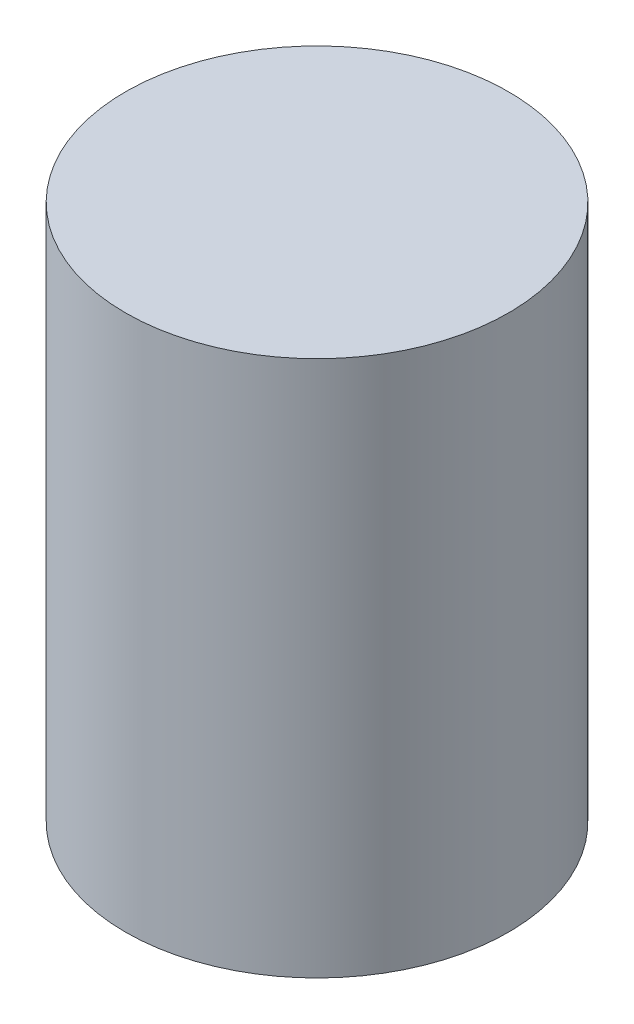
ISO-10303-21;
HEADER;
FILE_DESCRIPTION(('STEP AP214'),'2;1');
FILE_NAME('part.step','',(''),(''),'','','');
FILE_SCHEMA(('AUTOMOTIVE_DESIGN { 1 0 10303 214 1 1 1 1 }'));
ENDSEC;
DATA;
#1=APPLICATION_CONTEXT('core data for automotive mechanical design processes');
#2=APPLICATION_PROTOCOL_DEFINITION('international standard','automotive_design',2000,#1);
#3=PRODUCT_CONTEXT('',#1,'mechanical');
#4=PRODUCT('Part','Part','',(#3));
#5=PRODUCT_RELATED_PRODUCT_CATEGORY('part','',(#4));
#6=PRODUCT_DEFINITION_FORMATION('','',#4);
#7=PRODUCT_DEFINITION_CONTEXT('part definition',#1,'design');
#8=PRODUCT_DEFINITION('design','',#6,#7);
#9=PRODUCT_DEFINITION_SHAPE('','',#8);
#10=(LENGTH_UNIT() NAMED_UNIT(*) SI_UNIT(.MILLI.,.METRE.));
#11=(NAMED_UNIT(*) PLANE_ANGLE_UNIT() SI_UNIT($,.RADIAN.));
#12=(NAMED_UNIT(*) SI_UNIT($,.STERADIAN.) SOLID_ANGLE_UNIT());
#13=UNCERTAINTY_MEASURE_WITH_UNIT(LENGTH_MEASURE(1.E-05),#10,'distance_accuracy_value','');
#14=(GEOMETRIC_REPRESENTATION_CONTEXT(3) GLOBAL_UNCERTAINTY_ASSIGNED_CONTEXT((#13)) GLOBAL_UNIT_ASSIGNED_CONTEXT((#10,
#11,#12)) REPRESENTATION_CONTEXT('',''));
#15=CARTESIAN_POINT('',(0.,0.,0.));
#16=DIRECTION('',(0.,0.,1.));
#17=DIRECTION('',(1.,0.,0.));
#18=AXIS2_PLACEMENT_3D('',#15,#16,#17);
#19=CARTESIAN_POINT('',(0.,-483.965591397849,-381.));
#20=DIRECTION('',(0.,1.,0.));
#21=DIRECTION('',(0.,0.,1.));
#22=AXIS2_PLACEMENT_3D('',#19,#20,#21);
#23=PLANE('',#22);
#24=CARTESIAN_POINT('',(0.,-483.965591397849,0.));
#25=DIRECTION('',(0.,1.,0.));
#26=DIRECTION('',(0.,0.,1.));
#27=AXIS2_PLACEMENT_3D('',#24,#25,#26);
#28=CIRCLE('',#27,381.);
#29=CARTESIAN_POINT('',(0.,-483.965591397849,381.));
#30=VERTEX_POINT('',#29);
#31=EDGE_CURVE('E46',#30,#30,#28,.T.);
#32=ORIENTED_EDGE('',*,*,#31,.F.);
#33=EDGE_LOOP('',(#32));
#34=FACE_BOUND('',#33,.T.);
#35=ADVANCED_FACE('F34',(#34),#23,.F.);
#36=CARTESIAN_POINT('',(0.,582.834408602151,0.));
#37=DIRECTION('',(0.,1.,0.));
#38=DIRECTION('',(0.,0.,1.));
#39=AXIS2_PLACEMENT_3D('',#36,#37,#38);
#40=CYLINDRICAL_SURFACE('',#39,381.);
#41=CARTESIAN_POINT('',(0.,582.834408602151,0.));
#42=DIRECTION('',(0.,1.,0.));
#43=DIRECTION('',(0.,0.,1.));
#44=AXIS2_PLACEMENT_3D('',#41,#42,#43);
#45=CIRCLE('',#44,381.);
#46=CARTESIAN_POINT('',(0.,582.834408602151,381.));
#47=VERTEX_POINT('',#46);
#48=EDGE_CURVE('E50',#47,#47,#45,.T.);
#49=ORIENTED_EDGE('',*,*,#48,.F.);
#50=EDGE_LOOP('',(#49));
#51=FACE_BOUND('',#50,.T.);
#52=ORIENTED_EDGE('',*,*,#31,.T.);
#53=EDGE_LOOP('',(#52));
#54=FACE_BOUND('',#53,.T.);
#55=ADVANCED_FACE('F58',(#51,#54),#40,.T.);
#56=CARTESIAN_POINT('',(0.,582.834408602151,0.));
#57=DIRECTION('',(0.,-1.,0.));
#58=DIRECTION('',(0.,0.,-1.));
#59=AXIS2_PLACEMENT_3D('',#56,#57,#58);
#60=PLANE('',#59);
#61=ORIENTED_EDGE('',*,*,#48,.T.);
#62=EDGE_LOOP('',(#61));
#63=FACE_BOUND('',#62,.T.);
#64=ADVANCED_FACE('F56',(#63),#60,.F.);
#65=CLOSED_SHELL('',(#35,#55,#64));
#66=CARTESIAN_POINT('',(0.,576.484408602151,0.));
#67=DIRECTION('',(0.,1.,0.));
#68=DIRECTION('',(0.,0.,1.));
#69=AXIS2_PLACEMENT_3D('',#66,#67,#68);
#70=PLANE('',#69);
#71=CARTESIAN_POINT('',(0.,576.484408602151,0.));
#72=DIRECTION('',(0.,1.,0.));
#73=DIRECTION('',(0.,0.,1.));
#74=AXIS2_PLACEMENT_3D('',#71,#72,#73);
#75=CIRCLE('',#74,374.65);
#76=CARTESIAN_POINT('',(0.,576.484408602151,374.65));
#77=VERTEX_POINT('',#76);
#78=EDGE_CURVE('E10',#77,#77,#75,.T.);
#79=ORIENTED_EDGE('',*,*,#78,.F.);
#80=EDGE_LOOP('',(#79));
#81=FACE_BOUND('',#80,.T.);
#82=ADVANCED_FACE('F36',(#81),#70,.F.);
#83=CARTESIAN_POINT('',(0.,582.834408602151,0.));
#84=DIRECTION('',(0.,1.,0.));
#85=DIRECTION('',(0.,0.,1.));
#86=AXIS2_PLACEMENT_3D('',#83,#84,#85);
#87=CYLINDRICAL_SURFACE('',#86,374.65);
#88=CARTESIAN_POINT('',(0.,-477.615591397849,0.));
#89=DIRECTION('',(0.,1.,0.));
#90=DIRECTION('',(0.,0.,1.));
#91=AXIS2_PLACEMENT_3D('',#88,#89,#90);
#92=CIRCLE('',#91,374.65);
#93=CARTESIAN_POINT('',(0.,-477.615591397849,374.65));
#94=VERTEX_POINT('',#93);
#95=EDGE_CURVE('E42',#94,#94,#92,.T.);
#96=ORIENTED_EDGE('',*,*,#95,.F.);
#97=EDGE_LOOP('',(#96));
#98=FACE_BOUND('',#97,.T.);
#99=ORIENTED_EDGE('',*,*,#78,.T.);
#100=EDGE_LOOP('',(#99));
#101=FACE_BOUND('',#100,.T.);
#102=ADVANCED_FACE('F72',(#98,#101),#87,.F.);
#103=CARTESIAN_POINT('',(0.,-477.615591397849,-374.65));
#104=DIRECTION('',(0.,-1.,0.));
#105=DIRECTION('',(0.,0.,-1.));
#106=AXIS2_PLACEMENT_3D('',#103,#104,#105);
#107=PLANE('',#106);
#108=ORIENTED_EDGE('',*,*,#95,.T.);
#109=EDGE_LOOP('',(#108));
#110=FACE_BOUND('',#109,.T.);
#111=ADVANCED_FACE('F70',(#110),#107,.F.);
#112=CLOSED_SHELL('',(#82,#102,#111));
#113=ORIENTED_CLOSED_SHELL('',*,#112,.T.);
#114=BREP_WITH_VOIDS('B2',#65,(#113));
#115=ADVANCED_BREP_SHAPE_REPRESENTATION('',(#18,#114),#14);
#116=SHAPE_DEFINITION_REPRESENTATION(#9,#115);
ENDSEC;
END-ISO-10303-21;
